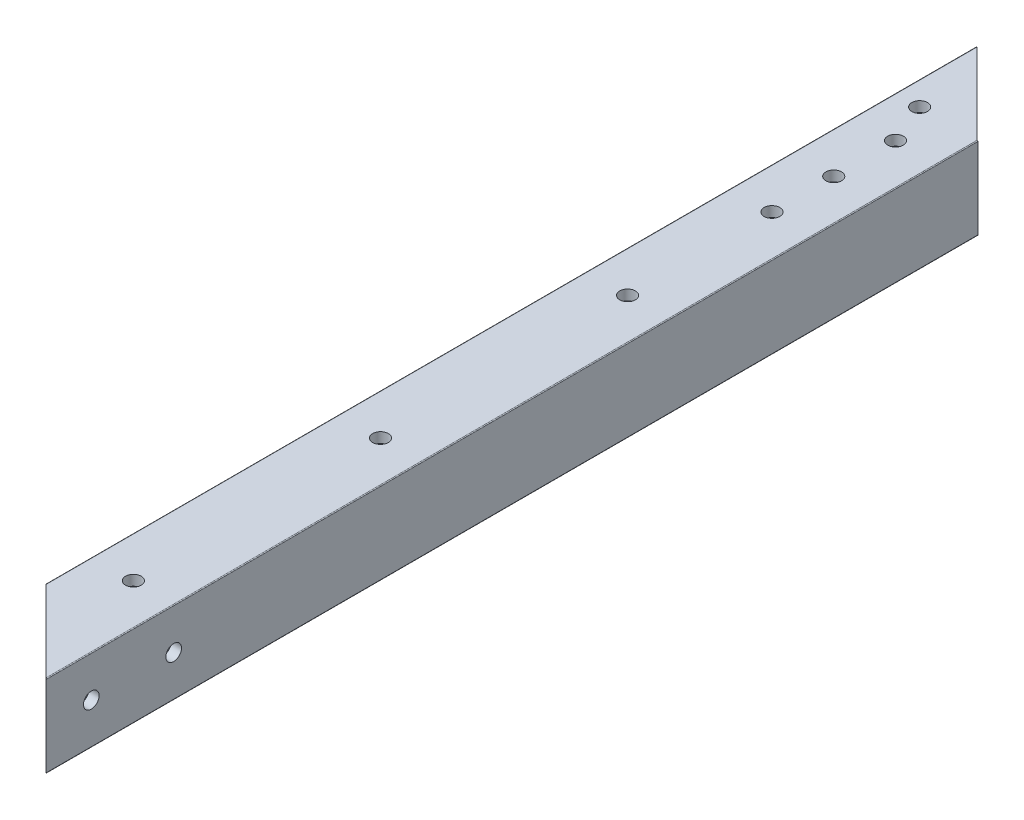
ISO-10303-21;
HEADER;
FILE_DESCRIPTION(('STEP AP214'),'2;1');
FILE_NAME('part.step','',(''),(''),'','','');
FILE_SCHEMA(('AUTOMOTIVE_DESIGN { 1 0 10303 214 1 1 1 1 }'));
ENDSEC;
DATA;
#1=APPLICATION_CONTEXT('core data for automotive mechanical design processes');
#2=APPLICATION_PROTOCOL_DEFINITION('international standard','automotive_design',2000,#1);
#3=PRODUCT_CONTEXT('',#1,'mechanical');
#4=PRODUCT('Part','Part','',(#3));
#5=PRODUCT_RELATED_PRODUCT_CATEGORY('part','',(#4));
#6=PRODUCT_DEFINITION_FORMATION('','',#4);
#7=PRODUCT_DEFINITION_CONTEXT('part definition',#1,'design');
#8=PRODUCT_DEFINITION('design','',#6,#7);
#9=PRODUCT_DEFINITION_SHAPE('','',#8);
#10=(LENGTH_UNIT() NAMED_UNIT(*) SI_UNIT(.MILLI.,.METRE.));
#11=(NAMED_UNIT(*) PLANE_ANGLE_UNIT() SI_UNIT($,.RADIAN.));
#12=(NAMED_UNIT(*) SI_UNIT($,.STERADIAN.) SOLID_ANGLE_UNIT());
#13=UNCERTAINTY_MEASURE_WITH_UNIT(LENGTH_MEASURE(1.E-05),#10,'distance_accuracy_value','');
#14=(GEOMETRIC_REPRESENTATION_CONTEXT(3) GLOBAL_UNCERTAINTY_ASSIGNED_CONTEXT((#13)) GLOBAL_UNIT_ASSIGNED_CONTEXT((#10,
#11,#12)) REPRESENTATION_CONTEXT('',''));
#15=CARTESIAN_POINT('',(0.,0.,0.));
#16=DIRECTION('',(0.,0.,1.));
#17=DIRECTION('',(1.,0.,0.));
#18=AXIS2_PLACEMENT_3D('',#15,#16,#17);
#19=CARTESIAN_POINT('',(3.175,4.7625,1828.8));
#20=DIRECTION('',(1.,0.,0.));
#21=DIRECTION('',(0.,1.,0.));
#22=AXIS2_PLACEMENT_3D('',#19,#20,#21);
#23=PLANE('',#22);
#24=DIRECTION('',(0.,1.,0.));
#25=VECTOR('',#24,1.);
#26=CARTESIAN_POINT('',(3.175,4.7625,1806.575));
#27=LINE('',#26,#25);
#28=CARTESIAN_POINT('',(3.175,4.7625,1806.575));
#29=VERTEX_POINT('',#28);
#30=CARTESIAN_POINT('',(3.175,20.6375,1806.575));
#31=VERTEX_POINT('',#30);
#32=EDGE_CURVE('E317',#29,#31,#27,.T.);
#33=ORIENTED_EDGE('',*,*,#32,.F.);
#34=DIRECTION('',(0.,0.,-1.));
#35=VECTOR('',#34,1.);
#36=CARTESIAN_POINT('',(3.175,4.7625,1828.8));
#37=LINE('',#36,#35);
#38=CARTESIAN_POINT('',(3.175,4.7625,1519.555));
#39=VERTEX_POINT('',#38);
#40=EDGE_CURVE('E65',#29,#39,#37,.T.);
#41=ORIENTED_EDGE('',*,*,#40,.T.);
#42=DIRECTION('',(0.,-1.,0.));
#43=VECTOR('',#42,1.);
#44=CARTESIAN_POINT('',(3.175,4.7625,1519.555));
#45=LINE('',#44,#43);
#46=CARTESIAN_POINT('',(3.175,20.6375,1519.555));
#47=VERTEX_POINT('',#46);
#48=EDGE_CURVE('E263',#47,#39,#45,.T.);
#49=ORIENTED_EDGE('',*,*,#48,.F.);
#50=DIRECTION('',(0.,0.,-1.));
#51=VECTOR('',#50,1.);
#52=CARTESIAN_POINT('',(3.175,20.6375,1828.8));
#53=LINE('',#52,#51);
#54=EDGE_CURVE('E50',#31,#47,#53,.T.);
#55=ORIENTED_EDGE('',*,*,#54,.F.);
#56=EDGE_LOOP('',(#33,#41,#49,#55));
#57=FACE_BOUND('',#56,.T.);
#58=ADVANCED_FACE('F42',(#57),#23,.T.);
#59=CARTESIAN_POINT('',(4.7625,20.6375,1828.8));
#60=DIRECTION('',(0.,0.,-1.));
#61=DIRECTION('',(-1.,0.,0.));
#62=AXIS2_PLACEMENT_3D('',#59,#60,#61);
#63=CYLINDRICAL_SURFACE('',#62,1.5875);
#64=DIRECTION('',(0.,0.,-1.));
#65=VECTOR('',#64,1.);
#66=CARTESIAN_POINT('',(4.7625,22.225,1828.8));
#67=LINE('',#66,#65);
#68=CARTESIAN_POINT('',(4.7625,22.225,1808.1625));
#69=VERTEX_POINT('',#68);
#70=CARTESIAN_POINT('',(4.7625,22.225,1521.1425));
#71=VERTEX_POINT('',#70);
#72=EDGE_CURVE('E220',#69,#71,#67,.T.);
#73=ORIENTED_EDGE('',*,*,#72,.F.);
#74=CARTESIAN_POINT('',(4.7625,20.6375,1808.1625));
#75=DIRECTION('',(0.707106781186545,0.,-0.70710678118655));
#76=DIRECTION('',(-0.70710678118655,0.,-0.707106781186545));
#77=AXIS2_PLACEMENT_3D('',#74,#75,#76);
#78=ELLIPSE('',#77,2.24506403026728,1.5875);
#79=EDGE_CURVE('E310',#69,#31,#78,.F.);
#80=ORIENTED_EDGE('',*,*,#79,.T.);
#81=ORIENTED_EDGE('',*,*,#54,.T.);
#82=CARTESIAN_POINT('',(4.7625,20.6375,1521.1425));
#83=DIRECTION('',(-0.707106781186544,0.,0.707106781186551));
#84=DIRECTION('',(-0.707106781186551,0.,-0.707106781186544));
#85=AXIS2_PLACEMENT_3D('',#82,#83,#84);
#86=ELLIPSE('',#85,2.24506403026728,1.5875);
#87=EDGE_CURVE('E256',#47,#71,#86,.F.);
#88=ORIENTED_EDGE('',*,*,#87,.T.);
#89=EDGE_LOOP('',(#73,#80,#81,#88));
#90=FACE_BOUND('',#89,.T.);
#91=ADVANCED_FACE('F261',(#90),#63,.F.);
#92=CARTESIAN_POINT('',(4.7625,22.225,1828.8));
#93=DIRECTION('',(0.,-1.,0.));
#94=DIRECTION('',(0.,0.,-1.));
#95=AXIS2_PLACEMENT_3D('',#92,#93,#94);
#96=PLANE('',#95);
#97=CARTESIAN_POINT('',(7.43948775786736,22.225,1541.43180412579));
#98=DIRECTION('',(0.,-1.,0.));
#99=DIRECTION('',(0.,0.,-1.));
#100=AXIS2_PLACEMENT_3D('',#97,#98,#99);
#101=CIRCLE('',#100,2.41299999999992);
#102=CARTESIAN_POINT('',(7.43948775786736,22.225,1539.01880412579));
#103=VERTEX_POINT('',#102);
#104=EDGE_CURVE('E507',#103,#103,#101,.T.);
#105=ORIENTED_EDGE('',*,*,#104,.F.);
#106=EDGE_LOOP('',(#105));
#107=FACE_BOUND('',#106,.T.);
#108=CARTESIAN_POINT('',(12.7000000000056,22.225,1554.13180412579));
#109=DIRECTION('',(0.,-1.,0.));
#110=DIRECTION('',(0.,0.,-1.));
#111=AXIS2_PLACEMENT_3D('',#108,#109,#110);
#112=CIRCLE('',#111,2.41300000000005);
#113=CARTESIAN_POINT('',(12.7000000000056,22.225,1551.71880412579));
#114=VERTEX_POINT('',#113);
#115=EDGE_CURVE('E501',#114,#114,#112,.T.);
#116=ORIENTED_EDGE('',*,*,#115,.F.);
#117=EDGE_LOOP('',(#116));
#118=FACE_BOUND('',#117,.T.);
#119=CARTESIAN_POINT('',(12.7000000000055,22.225,1573.18180412579));
#120=DIRECTION('',(0.,-1.,0.));
#121=DIRECTION('',(0.,0.,-1.));
#122=AXIS2_PLACEMENT_3D('',#119,#120,#121);
#123=CIRCLE('',#122,2.413);
#124=CARTESIAN_POINT('',(12.7000000000055,22.225,1570.76880412579));
#125=VERTEX_POINT('',#124);
#126=EDGE_CURVE('E495',#125,#125,#123,.T.);
#127=ORIENTED_EDGE('',*,*,#126,.F.);
#128=EDGE_LOOP('',(#127));
#129=FACE_BOUND('',#128,.T.);
#130=CARTESIAN_POINT('',(12.7000000000054,22.225,1592.23180412579));
#131=DIRECTION('',(0.,-1.,0.));
#132=DIRECTION('',(0.,0.,-1.));
#133=AXIS2_PLACEMENT_3D('',#130,#131,#132);
#134=CIRCLE('',#133,2.41300000000008);
#135=CARTESIAN_POINT('',(12.7000000000054,22.225,1589.81880412579));
#136=VERTEX_POINT('',#135);
#137=EDGE_CURVE('E489',#136,#136,#134,.T.);
#138=ORIENTED_EDGE('',*,*,#137,.F.);
#139=EDGE_LOOP('',(#138));
#140=FACE_BOUND('',#139,.T.);
#141=CARTESIAN_POINT('',(12.7,22.225,1789.15923163679));
#142=DIRECTION('',(0.,-1.,0.));
#143=DIRECTION('',(0.,0.,-1.));
#144=AXIS2_PLACEMENT_3D('',#141,#142,#143);
#145=CIRCLE('',#144,2.413);
#146=CARTESIAN_POINT('',(12.7,22.225,1786.74623163679));
#147=VERTEX_POINT('',#146);
#148=EDGE_CURVE('E511',#147,#147,#145,.F.);
#149=ORIENTED_EDGE('',*,*,#148,.T.);
#150=EDGE_LOOP('',(#149));
#151=FACE_BOUND('',#150,.T.);
#152=CARTESIAN_POINT('',(12.7,22.225,1712.95923163679));
#153=DIRECTION('',(0.,-1.,0.));
#154=DIRECTION('',(0.,0.,-1.));
#155=AXIS2_PLACEMENT_3D('',#152,#153,#154);
#156=CIRCLE('',#155,2.413);
#157=CARTESIAN_POINT('',(12.7,22.225,1710.54623163679));
#158=VERTEX_POINT('',#157);
#159=EDGE_CURVE('E518',#158,#158,#156,.F.);
#160=ORIENTED_EDGE('',*,*,#159,.T.);
#161=EDGE_LOOP('',(#160));
#162=FACE_BOUND('',#161,.T.);
#163=CARTESIAN_POINT('',(12.7,22.225,1636.75923163679));
#164=DIRECTION('',(0.,-1.,0.));
#165=DIRECTION('',(0.,0.,-1.));
#166=AXIS2_PLACEMENT_3D('',#163,#164,#165);
#167=CIRCLE('',#166,2.413);
#168=CARTESIAN_POINT('',(12.7,22.225,1634.34623163679));
#169=VERTEX_POINT('',#168);
#170=EDGE_CURVE('E510',#169,#169,#167,.F.);
#171=ORIENTED_EDGE('',*,*,#170,.T.);
#172=EDGE_LOOP('',(#171));
#173=FACE_BOUND('',#172,.T.);
#174=DIRECTION('',(0.70710678118655,0.,0.707106781186545));
#175=VECTOR('',#174,1.);
#176=CARTESIAN_POINT('',(15.08125,22.225,1818.48125));
#177=LINE('',#176,#175);
#178=CARTESIAN_POINT('',(20.6375,22.225,1824.0375));
#179=VERTEX_POINT('',#178);
#180=EDGE_CURVE('E247',#69,#179,#177,.T.);
#181=ORIENTED_EDGE('',*,*,#180,.F.);
#182=ORIENTED_EDGE('',*,*,#72,.T.);
#183=DIRECTION('',(-0.707106781186551,0.,-0.707106781186544));
#184=VECTOR('',#183,1.);
#185=CARTESIAN_POINT('',(158.59125,22.225,1674.97125));
#186=LINE('',#185,#184);
#187=CARTESIAN_POINT('',(20.6375,22.225,1537.0175));
#188=VERTEX_POINT('',#187);
#189=EDGE_CURVE('E246',#188,#71,#186,.T.);
#190=ORIENTED_EDGE('',*,*,#189,.F.);
#191=DIRECTION('',(0.,0.,-1.));
#192=VECTOR('',#191,1.);
#193=CARTESIAN_POINT('',(20.6375,22.225,1828.8));
#194=LINE('',#193,#192);
#195=EDGE_CURVE('E237',#179,#188,#194,.T.);
#196=ORIENTED_EDGE('',*,*,#195,.F.);
#197=EDGE_LOOP('',(#181,#182,#190,#196));
#198=FACE_BOUND('',#197,.T.);
#199=ADVANCED_FACE('F244',(#107,#118,#129,#140,#151,#162,#173,#198),#96,.T.);
#200=CARTESIAN_POINT('',(20.6375,20.6375,1828.8));
#201=DIRECTION('',(0.,0.,-1.));
#202=DIRECTION('',(-1.,0.,0.));
#203=AXIS2_PLACEMENT_3D('',#200,#201,#202);
#204=CYLINDRICAL_SURFACE('',#203,1.5875);
#205=DIRECTION('',(0.,0.,-1.));
#206=VECTOR('',#205,1.);
#207=CARTESIAN_POINT('',(22.225,20.6375,1828.8));
#208=LINE('',#207,#206);
#209=CARTESIAN_POINT('',(22.225,20.6375,1825.625));
#210=VERTEX_POINT('',#209);
#211=CARTESIAN_POINT('',(22.225,20.6375,1538.605));
#212=VERTEX_POINT('',#211);
#213=EDGE_CURVE('E195',#210,#212,#208,.T.);
#214=ORIENTED_EDGE('',*,*,#213,.F.);
#215=CARTESIAN_POINT('',(20.6375,20.6375,1824.0375));
#216=DIRECTION('',(0.707106781186545,0.,-0.70710678118655));
#217=DIRECTION('',(-0.70710678118655,0.,-0.707106781186545));
#218=AXIS2_PLACEMENT_3D('',#215,#216,#217);
#219=ELLIPSE('',#218,2.24506403026728,1.5875);
#220=EDGE_CURVE('E306',#210,#179,#219,.F.);
#221=ORIENTED_EDGE('',*,*,#220,.T.);
#222=ORIENTED_EDGE('',*,*,#195,.T.);
#223=CARTESIAN_POINT('',(20.6375,20.6375,1537.0175));
#224=DIRECTION('',(-0.707106781186544,0.,0.707106781186551));
#225=DIRECTION('',(-0.707106781186551,0.,-0.707106781186544));
#226=AXIS2_PLACEMENT_3D('',#223,#224,#225);
#227=ELLIPSE('',#226,2.24506403026728,1.5875);
#228=EDGE_CURVE('E259',#188,#212,#227,.F.);
#229=ORIENTED_EDGE('',*,*,#228,.T.);
#230=EDGE_LOOP('',(#214,#221,#222,#229));
#231=FACE_BOUND('',#230,.T.);
#232=ADVANCED_FACE('F304',(#231),#204,.F.);
#233=CARTESIAN_POINT('',(22.225,4.7625,1828.8));
#234=DIRECTION('',(-1.,0.,0.));
#235=DIRECTION('',(0.,0.,1.));
#236=AXIS2_PLACEMENT_3D('',#233,#234,#235);
#237=PLANE('',#236);
#238=CARTESIAN_POINT('',(22.225,12.7,1814.83));
#239=DIRECTION('',(-1.,0.,0.));
#240=DIRECTION('',(0.,0.,1.));
#241=AXIS2_PLACEMENT_3D('',#238,#239,#240);
#242=CIRCLE('',#241,2.4130000000001);
#243=CARTESIAN_POINT('',(22.225,12.7,1817.243));
#244=VERTEX_POINT('',#243);
#245=EDGE_CURVE('E449',#244,#244,#242,.F.);
#246=ORIENTED_EDGE('',*,*,#245,.T.);
#247=EDGE_LOOP('',(#246));
#248=FACE_BOUND('',#247,.T.);
#249=CARTESIAN_POINT('',(22.225,12.7,1789.43));
#250=DIRECTION('',(-1.,0.,0.));
#251=DIRECTION('',(0.,0.,1.));
#252=AXIS2_PLACEMENT_3D('',#249,#250,#251);
#253=CIRCLE('',#252,2.4130000000001);
#254=CARTESIAN_POINT('',(22.225,12.7,1791.843));
#255=VERTEX_POINT('',#254);
#256=EDGE_CURVE('E461',#255,#255,#253,.F.);
#257=ORIENTED_EDGE('',*,*,#256,.T.);
#258=EDGE_LOOP('',(#257));
#259=FACE_BOUND('',#258,.T.);
#260=DIRECTION('',(0.,-1.,0.));
#261=VECTOR('',#260,1.);
#262=CARTESIAN_POINT('',(22.225,4.7625,1825.625));
#263=LINE('',#262,#261);
#264=CARTESIAN_POINT('',(22.225,4.7625,1825.625));
#265=VERTEX_POINT('',#264);
#266=EDGE_CURVE('E308',#210,#265,#263,.T.);
#267=ORIENTED_EDGE('',*,*,#266,.F.);
#268=ORIENTED_EDGE('',*,*,#213,.T.);
#269=DIRECTION('',(0.,1.,0.));
#270=VECTOR('',#269,1.);
#271=CARTESIAN_POINT('',(22.225,4.7625,1538.605));
#272=LINE('',#271,#270);
#273=CARTESIAN_POINT('',(22.225,4.7625,1538.605));
#274=VERTEX_POINT('',#273);
#275=EDGE_CURVE('E301',#274,#212,#272,.T.);
#276=ORIENTED_EDGE('',*,*,#275,.F.);
#277=DIRECTION('',(0.,0.,-1.));
#278=VECTOR('',#277,1.);
#279=CARTESIAN_POINT('',(22.225,4.7625,1828.8));
#280=LINE('',#279,#278);
#281=EDGE_CURVE('E204',#265,#274,#280,.T.);
#282=ORIENTED_EDGE('',*,*,#281,.F.);
#283=EDGE_LOOP('',(#267,#268,#276,#282));
#284=FACE_BOUND('',#283,.T.);
#285=ADVANCED_FACE('F352',(#248,#259,#284),#237,.T.);
#286=CARTESIAN_POINT('',(20.6375,4.7625,1828.8));
#287=DIRECTION('',(0.,0.,-1.));
#288=DIRECTION('',(-1.,0.,0.));
#289=AXIS2_PLACEMENT_3D('',#286,#287,#288);
#290=CYLINDRICAL_SURFACE('',#289,1.5875);
#291=DIRECTION('',(0.,0.,-1.));
#292=VECTOR('',#291,1.);
#293=CARTESIAN_POINT('',(20.6375,3.175,1828.8));
#294=LINE('',#293,#292);
#295=CARTESIAN_POINT('',(20.6375,3.175,1824.0375));
#296=VERTEX_POINT('',#295);
#297=CARTESIAN_POINT('',(20.6375,3.175,1537.0175));
#298=VERTEX_POINT('',#297);
#299=EDGE_CURVE('E203',#296,#298,#294,.T.);
#300=ORIENTED_EDGE('',*,*,#299,.F.);
#301=CARTESIAN_POINT('',(20.6375,4.7625,1824.0375));
#302=DIRECTION('',(0.707106781186545,0.,-0.70710678118655));
#303=DIRECTION('',(-0.70710678118655,0.,-0.707106781186545));
#304=AXIS2_PLACEMENT_3D('',#301,#302,#303);
#305=ELLIPSE('',#304,2.24506403026728,1.5875);
#306=EDGE_CURVE('E312',#296,#265,#305,.F.);
#307=ORIENTED_EDGE('',*,*,#306,.T.);
#308=ORIENTED_EDGE('',*,*,#281,.T.);
#309=CARTESIAN_POINT('',(20.6375,4.7625,1537.0175));
#310=DIRECTION('',(-0.707106781186544,0.,0.707106781186551));
#311=DIRECTION('',(-0.707106781186551,0.,-0.707106781186544));
#312=AXIS2_PLACEMENT_3D('',#309,#310,#311);
#313=ELLIPSE('',#312,2.24506403026728,1.5875);
#314=EDGE_CURVE('E298',#274,#298,#313,.F.);
#315=ORIENTED_EDGE('',*,*,#314,.T.);
#316=EDGE_LOOP('',(#300,#307,#308,#315));
#317=FACE_BOUND('',#316,.T.);
#318=ADVANCED_FACE('F348',(#317),#290,.F.);
#319=CARTESIAN_POINT('',(4.7625,3.175,1828.8));
#320=DIRECTION('',(0.,1.,0.));
#321=DIRECTION('',(1.,0.,0.));
#322=AXIS2_PLACEMENT_3D('',#319,#320,#321);
#323=PLANE('',#322);
#324=CARTESIAN_POINT('',(7.43948775786736,3.175,1541.43180412579));
#325=DIRECTION('',(0.,1.,0.));
#326=DIRECTION('',(0.,0.,1.));
#327=AXIS2_PLACEMENT_3D('',#324,#325,#326);
#328=CIRCLE('',#327,2.41299999999992);
#329=CARTESIAN_POINT('',(7.43948775786736,3.175,1543.84480412579));
#330=VERTEX_POINT('',#329);
#331=EDGE_CURVE('E504',#330,#330,#328,.T.);
#332=ORIENTED_EDGE('',*,*,#331,.F.);
#333=EDGE_LOOP('',(#332));
#334=FACE_BOUND('',#333,.T.);
#335=CARTESIAN_POINT('',(12.7000000000056,3.175,1554.13180412579));
#336=DIRECTION('',(0.,1.,0.));
#337=DIRECTION('',(0.,0.,1.));
#338=AXIS2_PLACEMENT_3D('',#335,#336,#337);
#339=CIRCLE('',#338,2.41300000000005);
#340=CARTESIAN_POINT('',(12.7000000000056,3.175,1556.54480412579));
#341=VERTEX_POINT('',#340);
#342=EDGE_CURVE('E498',#341,#341,#339,.T.);
#343=ORIENTED_EDGE('',*,*,#342,.F.);
#344=EDGE_LOOP('',(#343));
#345=FACE_BOUND('',#344,.T.);
#346=CARTESIAN_POINT('',(12.7000000000055,3.175,1573.18180412579));
#347=DIRECTION('',(0.,1.,0.));
#348=DIRECTION('',(0.,0.,1.));
#349=AXIS2_PLACEMENT_3D('',#346,#347,#348);
#350=CIRCLE('',#349,2.413);
#351=CARTESIAN_POINT('',(12.7000000000055,3.175,1575.59480412579));
#352=VERTEX_POINT('',#351);
#353=EDGE_CURVE('E492',#352,#352,#350,.T.);
#354=ORIENTED_EDGE('',*,*,#353,.F.);
#355=EDGE_LOOP('',(#354));
#356=FACE_BOUND('',#355,.T.);
#357=CARTESIAN_POINT('',(12.7000000000054,3.175,1592.23180412579));
#358=DIRECTION('',(0.,1.,0.));
#359=DIRECTION('',(0.,0.,1.));
#360=AXIS2_PLACEMENT_3D('',#357,#358,#359);
#361=CIRCLE('',#360,2.41300000000008);
#362=CARTESIAN_POINT('',(12.7000000000054,3.175,1594.64480412579));
#363=VERTEX_POINT('',#362);
#364=EDGE_CURVE('E469',#363,#363,#361,.T.);
#365=ORIENTED_EDGE('',*,*,#364,.F.);
#366=EDGE_LOOP('',(#365));
#367=FACE_BOUND('',#366,.T.);
#368=DIRECTION('',(-0.70710678118655,0.,-0.707106781186545));
#369=VECTOR('',#368,1.);
#370=CARTESIAN_POINT('',(15.08125,3.175,1818.48125));
#371=LINE('',#370,#369);
#372=CARTESIAN_POINT('',(4.7625,3.175,1808.1625));
#373=VERTEX_POINT('',#372);
#374=EDGE_CURVE('E57',#296,#373,#371,.T.);
#375=ORIENTED_EDGE('',*,*,#374,.F.);
#376=ORIENTED_EDGE('',*,*,#299,.T.);
#377=DIRECTION('',(0.707106781186551,0.,0.707106781186544));
#378=VECTOR('',#377,1.);
#379=CARTESIAN_POINT('',(158.59125,3.175,1674.97125));
#380=LINE('',#379,#378);
#381=CARTESIAN_POINT('',(4.7625,3.175,1521.1425));
#382=VERTEX_POINT('',#381);
#383=EDGE_CURVE('E296',#382,#298,#380,.T.);
#384=ORIENTED_EDGE('',*,*,#383,.F.);
#385=DIRECTION('',(0.,0.,-1.));
#386=VECTOR('',#385,1.);
#387=CARTESIAN_POINT('',(4.7625,3.175,1828.8));
#388=LINE('',#387,#386);
#389=EDGE_CURVE('E205',#373,#382,#388,.T.);
#390=ORIENTED_EDGE('',*,*,#389,.F.);
#391=EDGE_LOOP('',(#375,#376,#384,#390));
#392=FACE_BOUND('',#391,.T.);
#393=ADVANCED_FACE('F353',(#334,#345,#356,#367,#392),#323,.T.);
#394=CARTESIAN_POINT('',(4.7625,4.7625,1828.8));
#395=DIRECTION('',(0.,0.,-1.));
#396=DIRECTION('',(-1.,0.,0.));
#397=AXIS2_PLACEMENT_3D('',#394,#395,#396);
#398=CYLINDRICAL_SURFACE('',#397,1.5875);
#399=ORIENTED_EDGE('',*,*,#40,.F.);
#400=CARTESIAN_POINT('',(4.7625,4.7625,1808.1625));
#401=DIRECTION('',(0.707106781186545,0.,-0.70710678118655));
#402=DIRECTION('',(-0.70710678118655,0.,-0.707106781186545));
#403=AXIS2_PLACEMENT_3D('',#400,#401,#402);
#404=ELLIPSE('',#403,2.24506403026728,1.5875);
#405=EDGE_CURVE('E343',#29,#373,#404,.F.);
#406=ORIENTED_EDGE('',*,*,#405,.T.);
#407=ORIENTED_EDGE('',*,*,#389,.T.);
#408=CARTESIAN_POINT('',(4.7625,4.7625,1521.1425));
#409=DIRECTION('',(-0.707106781186544,0.,0.707106781186551));
#410=DIRECTION('',(-0.707106781186551,0.,-0.707106781186544));
#411=AXIS2_PLACEMENT_3D('',#408,#409,#410);
#412=ELLIPSE('',#411,2.24506403026728,1.5875);
#413=EDGE_CURVE('E294',#382,#39,#412,.F.);
#414=ORIENTED_EDGE('',*,*,#413,.T.);
#415=EDGE_LOOP('',(#399,#406,#407,#414));
#416=FACE_BOUND('',#415,.T.);
#417=ADVANCED_FACE('F355',(#416),#398,.F.);
#418=CARTESIAN_POINT('',(0.,0.254,1828.8));
#419=DIRECTION('',(1.,0.,0.));
#420=DIRECTION('',(0.,1.,0.));
#421=AXIS2_PLACEMENT_3D('',#418,#419,#420);
#422=PLANE('',#421);
#423=DIRECTION('',(0.,0.,-1.));
#424=VECTOR('',#423,1.);
#425=CARTESIAN_POINT('',(0.,0.254,1828.8));
#426=LINE('',#425,#424);
#427=CARTESIAN_POINT('',(0.,0.254,1803.4));
#428=VERTEX_POINT('',#427);
#429=CARTESIAN_POINT('',(0.,0.254,1516.38));
#430=VERTEX_POINT('',#429);
#431=EDGE_CURVE('E187',#428,#430,#426,.T.);
#432=ORIENTED_EDGE('',*,*,#431,.F.);
#433=DIRECTION('',(0.,1.,0.));
#434=VECTOR('',#433,1.);
#435=CARTESIAN_POINT('',(0.,0.254,1803.4));
#436=LINE('',#435,#434);
#437=CARTESIAN_POINT('',(0.,25.146,1803.4));
#438=VERTEX_POINT('',#437);
#439=EDGE_CURVE('E168',#428,#438,#436,.T.);
#440=ORIENTED_EDGE('',*,*,#439,.T.);
#441=DIRECTION('',(0.,0.,-1.));
#442=VECTOR('',#441,1.);
#443=CARTESIAN_POINT('',(0.,25.146,1828.8));
#444=LINE('',#443,#442);
#445=CARTESIAN_POINT('',(0.,25.1460000000001,1516.38));
#446=VERTEX_POINT('',#445);
#447=EDGE_CURVE('E202',#438,#446,#444,.T.);
#448=ORIENTED_EDGE('',*,*,#447,.T.);
#449=DIRECTION('',(0.,-1.,0.));
#450=VECTOR('',#449,1.);
#451=CARTESIAN_POINT('',(0.,0.254,1516.38));
#452=LINE('',#451,#450);
#453=EDGE_CURVE('E192',#446,#430,#452,.T.);
#454=ORIENTED_EDGE('',*,*,#453,.T.);
#455=EDGE_LOOP('',(#432,#440,#448,#454));
#456=FACE_BOUND('',#455,.T.);
#457=ADVANCED_FACE('F274',(#456),#422,.F.);
#458=CARTESIAN_POINT('',(0.254,25.146,1828.8));
#459=DIRECTION('',(0.,0.,-1.));
#460=DIRECTION('',(-1.,0.,0.));
#461=AXIS2_PLACEMENT_3D('',#458,#459,#460);
#462=CYLINDRICAL_SURFACE('',#461,0.254);
#463=CARTESIAN_POINT('',(0.254,25.146,1803.654));
#464=DIRECTION('',(0.707106781186545,0.,-0.70710678118655));
#465=DIRECTION('',(-0.70710678118655,0.,-0.707106781186545));
#466=AXIS2_PLACEMENT_3D('',#463,#464,#465);
#467=ELLIPSE('',#466,0.359210244842765,0.254);
#468=CARTESIAN_POINT('',(0.253999999999983,25.4,1803.654));
#469=VERTEX_POINT('',#468);
#470=EDGE_CURVE('E340',#469,#438,#467,.F.);
#471=ORIENTED_EDGE('',*,*,#470,.F.);
#472=DIRECTION('',(0.,0.,-1.));
#473=VECTOR('',#472,1.);
#474=CARTESIAN_POINT('',(0.254,25.4,1828.8));
#475=LINE('',#474,#473);
#476=CARTESIAN_POINT('',(0.25399999999999,25.4,1516.634));
#477=VERTEX_POINT('',#476);
#478=EDGE_CURVE('E199',#469,#477,#475,.T.);
#479=ORIENTED_EDGE('',*,*,#478,.T.);
#480=CARTESIAN_POINT('',(0.254,25.146,1516.634));
#481=DIRECTION('',(-0.707106781186544,0.,0.707106781186551));
#482=DIRECTION('',(-0.707106781186551,0.,-0.707106781186544));
#483=AXIS2_PLACEMENT_3D('',#480,#481,#482);
#484=ELLIPSE('',#483,0.359210244842764,0.254);
#485=EDGE_CURVE('E279',#446,#477,#484,.F.);
#486=ORIENTED_EDGE('',*,*,#485,.F.);
#487=ORIENTED_EDGE('',*,*,#447,.F.);
#488=EDGE_LOOP('',(#471,#479,#486,#487));
#489=FACE_BOUND('',#488,.T.);
#490=ADVANCED_FACE('F283',(#489),#462,.T.);
#491=CARTESIAN_POINT('',(0.254,25.4,1828.8));
#492=DIRECTION('',(0.,-1.,0.));
#493=DIRECTION('',(0.,0.,-1.));
#494=AXIS2_PLACEMENT_3D('',#491,#492,#493);
#495=PLANE('',#494);
#496=CARTESIAN_POINT('',(7.43948775786736,25.4,1541.43180412579));
#497=DIRECTION('',(0.,-1.,0.));
#498=DIRECTION('',(0.,0.,-1.));
#499=AXIS2_PLACEMENT_3D('',#496,#497,#498);
#500=CIRCLE('',#499,2.41299999999992);
#501=CARTESIAN_POINT('',(7.43948775786736,25.4,1539.01880412579));
#502=VERTEX_POINT('',#501);
#503=EDGE_CURVE('E466',#502,#502,#500,.T.);
#504=ORIENTED_EDGE('',*,*,#503,.T.);
#505=EDGE_LOOP('',(#504));
#506=FACE_BOUND('',#505,.T.);
#507=CARTESIAN_POINT('',(12.7000000000056,25.4,1554.13180412579));
#508=DIRECTION('',(0.,-1.,0.));
#509=DIRECTION('',(0.,0.,-1.));
#510=AXIS2_PLACEMENT_3D('',#507,#508,#509);
#511=CIRCLE('',#510,2.41300000000005);
#512=CARTESIAN_POINT('',(12.7000000000056,25.4,1551.71880412579));
#513=VERTEX_POINT('',#512);
#514=EDGE_CURVE('E473',#513,#513,#511,.T.);
#515=ORIENTED_EDGE('',*,*,#514,.T.);
#516=EDGE_LOOP('',(#515));
#517=FACE_BOUND('',#516,.T.);
#518=CARTESIAN_POINT('',(12.7000000000055,25.4,1573.18180412579));
#519=DIRECTION('',(0.,-1.,0.));
#520=DIRECTION('',(0.,0.,-1.));
#521=AXIS2_PLACEMENT_3D('',#518,#519,#520);
#522=CIRCLE('',#521,2.413);
#523=CARTESIAN_POINT('',(12.7000000000055,25.4,1570.76880412579));
#524=VERTEX_POINT('',#523);
#525=EDGE_CURVE('E479',#524,#524,#522,.T.);
#526=ORIENTED_EDGE('',*,*,#525,.T.);
#527=EDGE_LOOP('',(#526));
#528=FACE_BOUND('',#527,.T.);
#529=CARTESIAN_POINT('',(12.7000000000054,25.4,1592.23180412579));
#530=DIRECTION('',(0.,-1.,0.));
#531=DIRECTION('',(0.,0.,-1.));
#532=AXIS2_PLACEMENT_3D('',#529,#530,#531);
#533=CIRCLE('',#532,2.41300000000008);
#534=CARTESIAN_POINT('',(12.7000000000054,25.4,1589.81880412579));
#535=VERTEX_POINT('',#534);
#536=EDGE_CURVE('E456',#535,#535,#533,.T.);
#537=ORIENTED_EDGE('',*,*,#536,.T.);
#538=EDGE_LOOP('',(#537));
#539=FACE_BOUND('',#538,.T.);
#540=CARTESIAN_POINT('',(12.7,25.4,1789.15923163679));
#541=DIRECTION('',(0.,1.,0.));
#542=DIRECTION('',(0.,0.,1.));
#543=AXIS2_PLACEMENT_3D('',#540,#541,#542);
#544=CIRCLE('',#543,2.413);
#545=CARTESIAN_POINT('',(12.7,25.4,1791.57223163679));
#546=VERTEX_POINT('',#545);
#547=EDGE_CURVE('E514',#546,#546,#544,.T.);
#548=ORIENTED_EDGE('',*,*,#547,.F.);
#549=EDGE_LOOP('',(#548));
#550=FACE_BOUND('',#549,.T.);
#551=CARTESIAN_POINT('',(12.7,25.4,1712.95923163679));
#552=DIRECTION('',(0.,1.,0.));
#553=DIRECTION('',(0.,0.,1.));
#554=AXIS2_PLACEMENT_3D('',#551,#552,#553);
#555=CIRCLE('',#554,2.413);
#556=CARTESIAN_POINT('',(12.7,25.4,1715.37223163679));
#557=VERTEX_POINT('',#556);
#558=EDGE_CURVE('E515',#557,#557,#555,.T.);
#559=ORIENTED_EDGE('',*,*,#558,.F.);
#560=EDGE_LOOP('',(#559));
#561=FACE_BOUND('',#560,.T.);
#562=CARTESIAN_POINT('',(12.7,25.4,1636.75923163679));
#563=DIRECTION('',(0.,1.,0.));
#564=DIRECTION('',(0.,0.,1.));
#565=AXIS2_PLACEMENT_3D('',#562,#563,#564);
#566=CIRCLE('',#565,2.413);
#567=CARTESIAN_POINT('',(12.7,25.4,1639.17223163679));
#568=VERTEX_POINT('',#567);
#569=EDGE_CURVE('E521',#568,#568,#566,.T.);
#570=ORIENTED_EDGE('',*,*,#569,.F.);
#571=EDGE_LOOP('',(#570));
#572=FACE_BOUND('',#571,.T.);
#573=ORIENTED_EDGE('',*,*,#478,.F.);
#574=DIRECTION('',(-0.70710678118655,0.,-0.707106781186545));
#575=VECTOR('',#574,1.);
#576=CARTESIAN_POINT('',(34.1927663058368,25.4,1837.59276630584));
#577=LINE('',#576,#575);
#578=CARTESIAN_POINT('',(25.146,25.4,1828.546));
#579=VERTEX_POINT('',#578);
#580=EDGE_CURVE('E181',#579,#469,#577,.T.);
#581=ORIENTED_EDGE('',*,*,#580,.F.);
#582=DIRECTION('',(0.,0.,-1.));
#583=VECTOR('',#582,1.);
#584=CARTESIAN_POINT('',(25.146,25.4,1828.8));
#585=LINE('',#584,#583);
#586=CARTESIAN_POINT('',(25.146,25.4,1541.526));
#587=VERTEX_POINT('',#586);
#588=EDGE_CURVE('E197',#579,#587,#585,.T.);
#589=ORIENTED_EDGE('',*,*,#588,.T.);
#590=DIRECTION('',(0.707106781186551,0.,0.707106781186544));
#591=VECTOR('',#590,1.);
#592=CARTESIAN_POINT('',(25.2088679499494,25.4,1541.58886794995));
#593=LINE('',#592,#591);
#594=EDGE_CURVE('E319',#477,#587,#593,.T.);
#595=ORIENTED_EDGE('',*,*,#594,.F.);
#596=EDGE_LOOP('',(#573,#581,#589,#595));
#597=FACE_BOUND('',#596,.T.);
#598=ADVANCED_FACE('F389',(#506,#517,#528,#539,#550,#561,#572,#597),#495,.F.);
#599=CARTESIAN_POINT('',(25.146,25.146,1828.8));
#600=DIRECTION('',(0.,0.,-1.));
#601=DIRECTION('',(-1.,0.,0.));
#602=AXIS2_PLACEMENT_3D('',#599,#600,#601);
#603=CYLINDRICAL_SURFACE('',#602,0.254);
#604=CARTESIAN_POINT('',(25.146,25.146,1828.546));
#605=DIRECTION('',(0.707106781186545,0.,-0.70710678118655));
#606=DIRECTION('',(-0.70710678118655,0.,-0.707106781186545));
#607=AXIS2_PLACEMENT_3D('',#604,#605,#606);
#608=ELLIPSE('',#607,0.359210244842765,0.254);
#609=CARTESIAN_POINT('',(25.4000000000002,25.146,1828.8));
#610=VERTEX_POINT('',#609);
#611=EDGE_CURVE('E333',#610,#579,#608,.F.);
#612=ORIENTED_EDGE('',*,*,#611,.F.);
#613=DIRECTION('',(0.,0.,-1.));
#614=VECTOR('',#613,1.);
#615=CARTESIAN_POINT('',(25.4,25.146,1828.8));
#616=LINE('',#615,#614);
#617=CARTESIAN_POINT('',(25.4,25.146,1541.3977358999));
#618=VERTEX_POINT('',#617);
#619=EDGE_CURVE('E200',#610,#618,#616,.T.);
#620=ORIENTED_EDGE('',*,*,#619,.T.);
#621=CARTESIAN_POINT('',(25.146,25.146,1541.6517358999));
#622=DIRECTION('',(0.707106781186552,0.,0.707106781186543));
#623=DIRECTION('',(0.707106781186543,0.,-0.707106781186552));
#624=AXIS2_PLACEMENT_3D('',#621,#622,#623);
#625=ELLIPSE('',#624,0.359210244842768,0.254);
#626=CARTESIAN_POINT('',(25.2088679499494,25.3920967713506,1541.58886794995));
#627=VERTEX_POINT('',#626);
#628=EDGE_CURVE('E270',#627,#618,#625,.F.);
#629=ORIENTED_EDGE('',*,*,#628,.F.);
#630=CARTESIAN_POINT('',(25.146,25.146,1541.526));
#631=DIRECTION('',(-0.707106781186544,0.,0.707106781186551));
#632=DIRECTION('',(-0.707106781186551,0.,-0.707106781186544));
#633=AXIS2_PLACEMENT_3D('',#630,#631,#632);
#634=ELLIPSE('',#633,0.359210244842764,0.254);
#635=EDGE_CURVE('E287',#587,#627,#634,.F.);
#636=ORIENTED_EDGE('',*,*,#635,.F.);
#637=ORIENTED_EDGE('',*,*,#588,.F.);
#638=EDGE_LOOP('',(#612,#620,#629,#636,#637));
#639=FACE_BOUND('',#638,.T.);
#640=ADVANCED_FACE('F44',(#639),#603,.T.);
#641=CARTESIAN_POINT('',(25.4,0.254,1828.8));
#642=DIRECTION('',(-1.,0.,0.));
#643=DIRECTION('',(0.,0.,1.));
#644=AXIS2_PLACEMENT_3D('',#641,#642,#643);
#645=PLANE('',#644);
#646=CARTESIAN_POINT('',(25.4,12.7,1814.83));
#647=DIRECTION('',(1.,0.,0.));
#648=DIRECTION('',(0.,0.,-1.));
#649=AXIS2_PLACEMENT_3D('',#646,#647,#648);
#650=CIRCLE('',#649,2.4130000000001);
#651=CARTESIAN_POINT('',(25.4,12.7,1812.417));
#652=VERTEX_POINT('',#651);
#653=EDGE_CURVE('E452',#652,#652,#650,.T.);
#654=ORIENTED_EDGE('',*,*,#653,.F.);
#655=EDGE_LOOP('',(#654));
#656=FACE_BOUND('',#655,.T.);
#657=CARTESIAN_POINT('',(25.4,12.7,1789.43));
#658=DIRECTION('',(1.,0.,0.));
#659=DIRECTION('',(0.,0.,-1.));
#660=AXIS2_PLACEMENT_3D('',#657,#658,#659);
#661=CIRCLE('',#660,2.4130000000001);
#662=CARTESIAN_POINT('',(25.4,12.7,1787.017));
#663=VERTEX_POINT('',#662);
#664=EDGE_CURVE('E458',#663,#663,#661,.T.);
#665=ORIENTED_EDGE('',*,*,#664,.F.);
#666=EDGE_LOOP('',(#665));
#667=FACE_BOUND('',#666,.T.);
#668=DIRECTION('',(0.,0.,-1.));
#669=VECTOR('',#668,1.);
#670=CARTESIAN_POINT('',(25.4,0.254,1828.8));
#671=LINE('',#670,#669);
#672=CARTESIAN_POINT('',(25.4,0.254,1828.8));
#673=VERTEX_POINT('',#672);
#674=CARTESIAN_POINT('',(25.4,0.254,1541.3977358999));
#675=VERTEX_POINT('',#674);
#676=EDGE_CURVE('E221',#673,#675,#671,.T.);
#677=ORIENTED_EDGE('',*,*,#676,.T.);
#678=DIRECTION('',(0.,1.,0.));
#679=VECTOR('',#678,1.);
#680=CARTESIAN_POINT('',(25.4,0.254,1541.3977358999));
#681=LINE('',#680,#679);
#682=EDGE_CURVE('E265',#675,#618,#681,.T.);
#683=ORIENTED_EDGE('',*,*,#682,.T.);
#684=ORIENTED_EDGE('',*,*,#619,.F.);
#685=DIRECTION('',(0.,1.,0.));
#686=VECTOR('',#685,1.);
#687=CARTESIAN_POINT('',(25.4,0.254,1828.8));
#688=LINE('',#687,#686);
#689=EDGE_CURVE('E188',#673,#610,#688,.T.);
#690=ORIENTED_EDGE('',*,*,#689,.F.);
#691=EDGE_LOOP('',(#677,#683,#684,#690));
#692=FACE_BOUND('',#691,.T.);
#693=ADVANCED_FACE('F334',(#656,#667,#692),#645,.F.);
#694=CARTESIAN_POINT('',(25.146,0.254,1828.8));
#695=DIRECTION('',(0.,0.,-1.));
#696=DIRECTION('',(-1.,0.,0.));
#697=AXIS2_PLACEMENT_3D('',#694,#695,#696);
#698=CYLINDRICAL_SURFACE('',#697,0.254);
#699=CARTESIAN_POINT('',(25.146,0.254,1828.546));
#700=DIRECTION('',(0.707106781186545,0.,-0.70710678118655));
#701=DIRECTION('',(-0.70710678118655,0.,-0.707106781186545));
#702=AXIS2_PLACEMENT_3D('',#699,#700,#701);
#703=ELLIPSE('',#702,0.359210244842765,0.254);
#704=CARTESIAN_POINT('',(25.146,0.,1828.546));
#705=VERTEX_POINT('',#704);
#706=EDGE_CURVE('E172',#705,#673,#703,.F.);
#707=ORIENTED_EDGE('',*,*,#706,.F.);
#708=DIRECTION('',(0.,0.,-1.));
#709=VECTOR('',#708,1.);
#710=CARTESIAN_POINT('',(25.146,0.,1828.8));
#711=LINE('',#710,#709);
#712=CARTESIAN_POINT('',(25.1460000000001,0.,1541.526));
#713=VERTEX_POINT('',#712);
#714=EDGE_CURVE('E180',#705,#713,#711,.T.);
#715=ORIENTED_EDGE('',*,*,#714,.T.);
#716=CARTESIAN_POINT('',(25.146,0.254,1541.526));
#717=DIRECTION('',(-0.707106781186544,0.,0.707106781186551));
#718=DIRECTION('',(-0.707106781186551,0.,-0.707106781186544));
#719=AXIS2_PLACEMENT_3D('',#716,#717,#718);
#720=ELLIPSE('',#719,0.359210244842764,0.254);
#721=CARTESIAN_POINT('',(25.2088679499494,0.00790322864945014,1541.58886794995));
#722=VERTEX_POINT('',#721);
#723=EDGE_CURVE('E285',#722,#713,#720,.F.);
#724=ORIENTED_EDGE('',*,*,#723,.F.);
#725=CARTESIAN_POINT('',(25.146,0.254,1541.6517358999));
#726=DIRECTION('',(0.707106781186552,0.,0.707106781186543));
#727=DIRECTION('',(0.707106781186543,0.,-0.707106781186552));
#728=AXIS2_PLACEMENT_3D('',#725,#726,#727);
#729=ELLIPSE('',#728,0.359210244842768,0.254);
#730=EDGE_CURVE('E11',#675,#722,#729,.F.);
#731=ORIENTED_EDGE('',*,*,#730,.F.);
#732=ORIENTED_EDGE('',*,*,#676,.F.);
#733=EDGE_LOOP('',(#707,#715,#724,#731,#732));
#734=FACE_BOUND('',#733,.T.);
#735=ADVANCED_FACE('F335',(#734),#698,.T.);
#736=CARTESIAN_POINT('',(0.254,0.,1828.8));
#737=DIRECTION('',(0.,1.,0.));
#738=DIRECTION('',(1.,0.,0.));
#739=AXIS2_PLACEMENT_3D('',#736,#737,#738);
#740=PLANE('',#739);
#741=CARTESIAN_POINT('',(7.43948775786736,0.,1541.43180412579));
#742=DIRECTION('',(0.,-1.,0.));
#743=DIRECTION('',(0.,0.,-1.));
#744=AXIS2_PLACEMENT_3D('',#741,#742,#743);
#745=CIRCLE('',#744,2.41299999999992);
#746=CARTESIAN_POINT('',(7.43948775786736,0.,1539.01880412579));
#747=VERTEX_POINT('',#746);
#748=EDGE_CURVE('E470',#747,#747,#745,.T.);
#749=ORIENTED_EDGE('',*,*,#748,.F.);
#750=EDGE_LOOP('',(#749));
#751=FACE_BOUND('',#750,.T.);
#752=CARTESIAN_POINT('',(12.7000000000056,0.,1554.13180412579));
#753=DIRECTION('',(0.,-1.,0.));
#754=DIRECTION('',(0.,0.,-1.));
#755=AXIS2_PLACEMENT_3D('',#752,#753,#754);
#756=CIRCLE('',#755,2.41300000000005);
#757=CARTESIAN_POINT('',(12.7000000000056,0.,1551.71880412579));
#758=VERTEX_POINT('',#757);
#759=EDGE_CURVE('E476',#758,#758,#756,.T.);
#760=ORIENTED_EDGE('',*,*,#759,.F.);
#761=EDGE_LOOP('',(#760));
#762=FACE_BOUND('',#761,.T.);
#763=CARTESIAN_POINT('',(12.7000000000055,0.,1573.18180412579));
#764=DIRECTION('',(0.,-1.,0.));
#765=DIRECTION('',(0.,0.,-1.));
#766=AXIS2_PLACEMENT_3D('',#763,#764,#765);
#767=CIRCLE('',#766,2.413);
#768=CARTESIAN_POINT('',(12.7000000000055,0.,1570.76880412579));
#769=VERTEX_POINT('',#768);
#770=EDGE_CURVE('E482',#769,#769,#767,.T.);
#771=ORIENTED_EDGE('',*,*,#770,.F.);
#772=EDGE_LOOP('',(#771));
#773=FACE_BOUND('',#772,.T.);
#774=CARTESIAN_POINT('',(12.7000000000054,0.,1592.23180412579));
#775=DIRECTION('',(0.,-1.,0.));
#776=DIRECTION('',(0.,0.,-1.));
#777=AXIS2_PLACEMENT_3D('',#774,#775,#776);
#778=CIRCLE('',#777,2.41300000000008);
#779=CARTESIAN_POINT('',(12.7000000000054,0.,1589.81880412579));
#780=VERTEX_POINT('',#779);
#781=EDGE_CURVE('E453',#780,#780,#778,.T.);
#782=ORIENTED_EDGE('',*,*,#781,.F.);
#783=EDGE_LOOP('',(#782));
#784=FACE_BOUND('',#783,.T.);
#785=ORIENTED_EDGE('',*,*,#714,.F.);
#786=DIRECTION('',(0.70710678118655,0.,0.707106781186545));
#787=VECTOR('',#786,1.);
#788=CARTESIAN_POINT('',(34.1927663058368,0.,1837.59276630584));
#789=LINE('',#788,#787);
#790=CARTESIAN_POINT('',(0.253999999999999,0.,1803.654));
#791=VERTEX_POINT('',#790);
#792=EDGE_CURVE('E165',#791,#705,#789,.T.);
#793=ORIENTED_EDGE('',*,*,#792,.F.);
#794=DIRECTION('',(0.,0.,-1.));
#795=VECTOR('',#794,1.);
#796=CARTESIAN_POINT('',(0.254,0.,1828.8));
#797=LINE('',#796,#795);
#798=CARTESIAN_POINT('',(0.253999999999995,0.,1516.634));
#799=VERTEX_POINT('',#798);
#800=EDGE_CURVE('E178',#791,#799,#797,.T.);
#801=ORIENTED_EDGE('',*,*,#800,.T.);
#802=DIRECTION('',(-0.707106781186551,0.,-0.707106781186544));
#803=VECTOR('',#802,1.);
#804=CARTESIAN_POINT('',(25.2088679499494,0.,1541.58886794995));
#805=LINE('',#804,#803);
#806=EDGE_CURVE('E289',#713,#799,#805,.T.);
#807=ORIENTED_EDGE('',*,*,#806,.F.);
#808=EDGE_LOOP('',(#785,#793,#801,#807));
#809=FACE_BOUND('',#808,.T.);
#810=ADVANCED_FACE('F176',(#751,#762,#773,#784,#809),#740,.F.);
#811=CARTESIAN_POINT('',(0.254,0.254,1828.8));
#812=DIRECTION('',(0.,0.,-1.));
#813=DIRECTION('',(-1.,0.,0.));
#814=AXIS2_PLACEMENT_3D('',#811,#812,#813);
#815=CYLINDRICAL_SURFACE('',#814,0.254);
#816=CARTESIAN_POINT('',(0.254,0.254,1803.654));
#817=DIRECTION('',(0.707106781186545,0.,-0.70710678118655));
#818=DIRECTION('',(-0.70710678118655,0.,-0.707106781186545));
#819=AXIS2_PLACEMENT_3D('',#816,#817,#818);
#820=ELLIPSE('',#819,0.359210244842765,0.254);
#821=EDGE_CURVE('E162',#428,#791,#820,.F.);
#822=ORIENTED_EDGE('',*,*,#821,.F.);
#823=ORIENTED_EDGE('',*,*,#431,.T.);
#824=CARTESIAN_POINT('',(0.254,0.254,1516.634));
#825=DIRECTION('',(-0.707106781186544,0.,0.707106781186551));
#826=DIRECTION('',(-0.707106781186551,0.,-0.707106781186544));
#827=AXIS2_PLACEMENT_3D('',#824,#825,#826);
#828=ELLIPSE('',#827,0.359210244842764,0.254);
#829=EDGE_CURVE('E186',#799,#430,#828,.F.);
#830=ORIENTED_EDGE('',*,*,#829,.F.);
#831=ORIENTED_EDGE('',*,*,#800,.F.);
#832=EDGE_LOOP('',(#822,#823,#830,#831));
#833=FACE_BOUND('',#832,.T.);
#834=ADVANCED_FACE('F184',(#833),#815,.T.);
#835=CARTESIAN_POINT('',(43.1693801920876,-76.2000000000001,1523.62835570781));
#836=DIRECTION('',(0.707106781186552,0.,0.707106781186543));
#837=DIRECTION('',(0.707106781186543,0.,-0.707106781186552));
#838=AXIS2_PLACEMENT_3D('',#835,#836,#837);
#839=PLANE('',#838);
#840=ORIENTED_EDGE('',*,*,#628,.T.);
#841=ORIENTED_EDGE('',*,*,#682,.F.);
#842=ORIENTED_EDGE('',*,*,#730,.T.);
#843=DIRECTION('',(0.,1.,0.));
#844=VECTOR('',#843,1.);
#845=CARTESIAN_POINT('',(25.2088679499494,-76.2000000000001,1541.58886794995));
#846=LINE('',#845,#844);
#847=EDGE_CURVE('E321',#722,#627,#846,.T.);
#848=ORIENTED_EDGE('',*,*,#847,.T.);
#849=EDGE_LOOP('',(#840,#841,#842,#848));
#850=FACE_BOUND('',#849,.T.);
#851=ADVANCED_FACE('F326',(#850),#839,.F.);
#852=CARTESIAN_POINT('',(25.2088679499494,-76.2000000000001,1541.58886794995));
#853=DIRECTION('',(-0.707106781186544,0.,0.707106781186551));
#854=DIRECTION('',(0.707106781186551,0.,0.707106781186544));
#855=AXIS2_PLACEMENT_3D('',#852,#853,#854);
#856=PLANE('',#855);
#857=ORIENTED_EDGE('',*,*,#48,.T.);
#858=ORIENTED_EDGE('',*,*,#413,.F.);
#859=ORIENTED_EDGE('',*,*,#383,.T.);
#860=ORIENTED_EDGE('',*,*,#314,.F.);
#861=ORIENTED_EDGE('',*,*,#275,.T.);
#862=ORIENTED_EDGE('',*,*,#228,.F.);
#863=ORIENTED_EDGE('',*,*,#189,.T.);
#864=ORIENTED_EDGE('',*,*,#87,.F.);
#865=EDGE_LOOP('',(#857,#858,#859,#860,#861,#862,#863,#864));
#866=FACE_BOUND('',#865,.T.);
#867=ORIENTED_EDGE('',*,*,#635,.T.);
#868=ORIENTED_EDGE('',*,*,#847,.F.);
#869=ORIENTED_EDGE('',*,*,#723,.T.);
#870=ORIENTED_EDGE('',*,*,#806,.T.);
#871=ORIENTED_EDGE('',*,*,#829,.T.);
#872=ORIENTED_EDGE('',*,*,#453,.F.);
#873=ORIENTED_EDGE('',*,*,#485,.T.);
#874=ORIENTED_EDGE('',*,*,#594,.T.);
#875=EDGE_LOOP('',(#867,#868,#869,#870,#871,#872,#873,#874));
#876=FACE_BOUND('',#875,.T.);
#877=ADVANCED_FACE('F254',(#866,#876),#856,.F.);
#878=CARTESIAN_POINT('',(34.1927663058368,-76.1999999999998,1837.59276630584));
#879=DIRECTION('',(0.707106781186545,0.,-0.70710678118655));
#880=DIRECTION('',(-0.70710678118655,0.,-0.707106781186545));
#881=AXIS2_PLACEMENT_3D('',#878,#879,#880);
#882=PLANE('',#881);
#883=ORIENTED_EDGE('',*,*,#32,.T.);
#884=ORIENTED_EDGE('',*,*,#79,.F.);
#885=ORIENTED_EDGE('',*,*,#180,.T.);
#886=ORIENTED_EDGE('',*,*,#220,.F.);
#887=ORIENTED_EDGE('',*,*,#266,.T.);
#888=ORIENTED_EDGE('',*,*,#306,.F.);
#889=ORIENTED_EDGE('',*,*,#374,.T.);
#890=ORIENTED_EDGE('',*,*,#405,.F.);
#891=EDGE_LOOP('',(#883,#884,#885,#886,#887,#888,#889,#890));
#892=FACE_BOUND('',#891,.T.);
#893=ORIENTED_EDGE('',*,*,#611,.T.);
#894=ORIENTED_EDGE('',*,*,#580,.T.);
#895=ORIENTED_EDGE('',*,*,#470,.T.);
#896=ORIENTED_EDGE('',*,*,#439,.F.);
#897=ORIENTED_EDGE('',*,*,#821,.T.);
#898=ORIENTED_EDGE('',*,*,#792,.T.);
#899=ORIENTED_EDGE('',*,*,#706,.T.);
#900=ORIENTED_EDGE('',*,*,#689,.T.);
#901=EDGE_LOOP('',(#893,#894,#895,#896,#897,#898,#899,#900));
#902=FACE_BOUND('',#901,.T.);
#903=ADVANCED_FACE('F164',(#892,#902),#882,.F.);
#904=CARTESIAN_POINT('',(12.7,-0.001000000000001,1636.75923163679));
#905=DIRECTION('',(0.,1.,0.));
#906=DIRECTION('',(0.,0.,1.));
#907=AXIS2_PLACEMENT_3D('',#904,#905,#906);
#908=CYLINDRICAL_SURFACE('',#907,2.413);
#909=ORIENTED_EDGE('',*,*,#170,.F.);
#910=EDGE_LOOP('',(#909));
#911=FACE_BOUND('',#910,.T.);
#912=ORIENTED_EDGE('',*,*,#569,.T.);
#913=EDGE_LOOP('',(#912));
#914=FACE_BOUND('',#913,.T.);
#915=ADVANCED_FACE('F405',(#911,#914),#908,.F.);
#916=CARTESIAN_POINT('',(12.7,-0.001000000000001,1712.95923163679));
#917=DIRECTION('',(0.,1.,0.));
#918=DIRECTION('',(0.,0.,1.));
#919=AXIS2_PLACEMENT_3D('',#916,#917,#918);
#920=CYLINDRICAL_SURFACE('',#919,2.413);
#921=ORIENTED_EDGE('',*,*,#159,.F.);
#922=EDGE_LOOP('',(#921));
#923=FACE_BOUND('',#922,.T.);
#924=ORIENTED_EDGE('',*,*,#558,.T.);
#925=EDGE_LOOP('',(#924));
#926=FACE_BOUND('',#925,.T.);
#927=ADVANCED_FACE('F408',(#923,#926),#920,.F.);
#928=CARTESIAN_POINT('',(12.7,-0.001000000000001,1789.15923163679));
#929=DIRECTION('',(0.,1.,0.));
#930=DIRECTION('',(0.,0.,1.));
#931=AXIS2_PLACEMENT_3D('',#928,#929,#930);
#932=CYLINDRICAL_SURFACE('',#931,2.413);
#933=ORIENTED_EDGE('',*,*,#148,.F.);
#934=EDGE_LOOP('',(#933));
#935=FACE_BOUND('',#934,.T.);
#936=ORIENTED_EDGE('',*,*,#547,.T.);
#937=EDGE_LOOP('',(#936));
#938=FACE_BOUND('',#937,.T.);
#939=ADVANCED_FACE('F412',(#935,#938),#932,.F.);
#940=CARTESIAN_POINT('',(12.7000000000054,25.4,1592.23180412579));
#941=DIRECTION('',(0.,-1.,0.));
#942=DIRECTION('',(0.,0.,-1.));
#943=AXIS2_PLACEMENT_3D('',#940,#941,#942);
#944=CYLINDRICAL_SURFACE('',#943,2.41300000000008);
#945=ORIENTED_EDGE('',*,*,#364,.T.);
#946=EDGE_LOOP('',(#945));
#947=FACE_BOUND('',#946,.T.);
#948=ORIENTED_EDGE('',*,*,#781,.T.);
#949=EDGE_LOOP('',(#948));
#950=FACE_BOUND('',#949,.T.);
#951=ADVANCED_FACE('F416',(#947,#950),#944,.F.);
#952=CARTESIAN_POINT('',(12.7000000000055,25.4,1573.18180412579));
#953=DIRECTION('',(0.,-1.,0.));
#954=DIRECTION('',(0.,0.,-1.));
#955=AXIS2_PLACEMENT_3D('',#952,#953,#954);
#956=CYLINDRICAL_SURFACE('',#955,2.413);
#957=ORIENTED_EDGE('',*,*,#353,.T.);
#958=EDGE_LOOP('',(#957));
#959=FACE_BOUND('',#958,.T.);
#960=ORIENTED_EDGE('',*,*,#770,.T.);
#961=EDGE_LOOP('',(#960));
#962=FACE_BOUND('',#961,.T.);
#963=ADVANCED_FACE('F420',(#959,#962),#956,.F.);
#964=CARTESIAN_POINT('',(12.7000000000056,25.4,1554.13180412579));
#965=DIRECTION('',(0.,-1.,0.));
#966=DIRECTION('',(0.,0.,-1.));
#967=AXIS2_PLACEMENT_3D('',#964,#965,#966);
#968=CYLINDRICAL_SURFACE('',#967,2.41300000000005);
#969=ORIENTED_EDGE('',*,*,#342,.T.);
#970=EDGE_LOOP('',(#969));
#971=FACE_BOUND('',#970,.T.);
#972=ORIENTED_EDGE('',*,*,#759,.T.);
#973=EDGE_LOOP('',(#972));
#974=FACE_BOUND('',#973,.T.);
#975=ADVANCED_FACE('F425',(#971,#974),#968,.F.);
#976=CARTESIAN_POINT('',(7.43948775786736,25.4,1541.43180412579));
#977=DIRECTION('',(0.,-1.,0.));
#978=DIRECTION('',(0.,0.,-1.));
#979=AXIS2_PLACEMENT_3D('',#976,#977,#978);
#980=CYLINDRICAL_SURFACE('',#979,2.41299999999992);
#981=ORIENTED_EDGE('',*,*,#331,.T.);
#982=EDGE_LOOP('',(#981));
#983=FACE_BOUND('',#982,.T.);
#984=ORIENTED_EDGE('',*,*,#748,.T.);
#985=EDGE_LOOP('',(#984));
#986=FACE_BOUND('',#985,.T.);
#987=ADVANCED_FACE('F430',(#983,#986),#980,.F.);
#988=ORIENTED_EDGE('',*,*,#137,.T.);
#989=EDGE_LOOP('',(#988));
#990=FACE_BOUND('',#989,.T.);
#991=ORIENTED_EDGE('',*,*,#536,.F.);
#992=EDGE_LOOP('',(#991));
#993=FACE_BOUND('',#992,.T.);
#994=ADVANCED_FACE('F422',(#990,#993),#944,.F.);
#995=ORIENTED_EDGE('',*,*,#126,.T.);
#996=EDGE_LOOP('',(#995));
#997=FACE_BOUND('',#996,.T.);
#998=ORIENTED_EDGE('',*,*,#525,.F.);
#999=EDGE_LOOP('',(#998));
#1000=FACE_BOUND('',#999,.T.);
#1001=ADVANCED_FACE('F427',(#997,#1000),#956,.F.);
#1002=ORIENTED_EDGE('',*,*,#115,.T.);
#1003=EDGE_LOOP('',(#1002));
#1004=FACE_BOUND('',#1003,.T.);
#1005=ORIENTED_EDGE('',*,*,#514,.F.);
#1006=EDGE_LOOP('',(#1005));
#1007=FACE_BOUND('',#1006,.T.);
#1008=ADVANCED_FACE('F432',(#1004,#1007),#968,.F.);
#1009=ORIENTED_EDGE('',*,*,#104,.T.);
#1010=EDGE_LOOP('',(#1009));
#1011=FACE_BOUND('',#1010,.T.);
#1012=ORIENTED_EDGE('',*,*,#503,.F.);
#1013=EDGE_LOOP('',(#1012));
#1014=FACE_BOUND('',#1013,.T.);
#1015=ADVANCED_FACE('F436',(#1011,#1014),#980,.F.);
#1016=CARTESIAN_POINT('',(-0.001000000000001,12.7,1789.43));
#1017=DIRECTION('',(1.,0.,0.));
#1018=DIRECTION('',(0.,0.,-1.));
#1019=AXIS2_PLACEMENT_3D('',#1016,#1017,#1018);
#1020=CYLINDRICAL_SURFACE('',#1019,2.4130000000001);
#1021=ORIENTED_EDGE('',*,*,#256,.F.);
#1022=EDGE_LOOP('',(#1021));
#1023=FACE_BOUND('',#1022,.T.);
#1024=ORIENTED_EDGE('',*,*,#664,.T.);
#1025=EDGE_LOOP('',(#1024));
#1026=FACE_BOUND('',#1025,.T.);
#1027=ADVANCED_FACE('F437',(#1023,#1026),#1020,.F.);
#1028=CARTESIAN_POINT('',(-0.001000000000001,12.7,1814.83));
#1029=DIRECTION('',(1.,0.,0.));
#1030=DIRECTION('',(0.,0.,-1.));
#1031=AXIS2_PLACEMENT_3D('',#1028,#1029,#1030);
#1032=CYLINDRICAL_SURFACE('',#1031,2.4130000000001);
#1033=ORIENTED_EDGE('',*,*,#245,.F.);
#1034=EDGE_LOOP('',(#1033));
#1035=FACE_BOUND('',#1034,.T.);
#1036=ORIENTED_EDGE('',*,*,#653,.T.);
#1037=EDGE_LOOP('',(#1036));
#1038=FACE_BOUND('',#1037,.T.);
#1039=ADVANCED_FACE('F440',(#1035,#1038),#1032,.F.);
#1040=CLOSED_SHELL('',(#58,#91,#199,#232,#285,#318,#393,#417,#457,#490,#598,#640,#693,#735,#810,
#834,#851,#877,#903,#915,#927,#939,#951,#963,#975,#987,#994,#1001,#1008,#1015,#1027,#1039));
#1041=MANIFOLD_SOLID_BREP('B2',#1040);
#1042=ADVANCED_BREP_SHAPE_REPRESENTATION('',(#18,#1041),#14);
#1043=SHAPE_DEFINITION_REPRESENTATION(#9,#1042);
ENDSEC;
END-ISO-10303-21;
